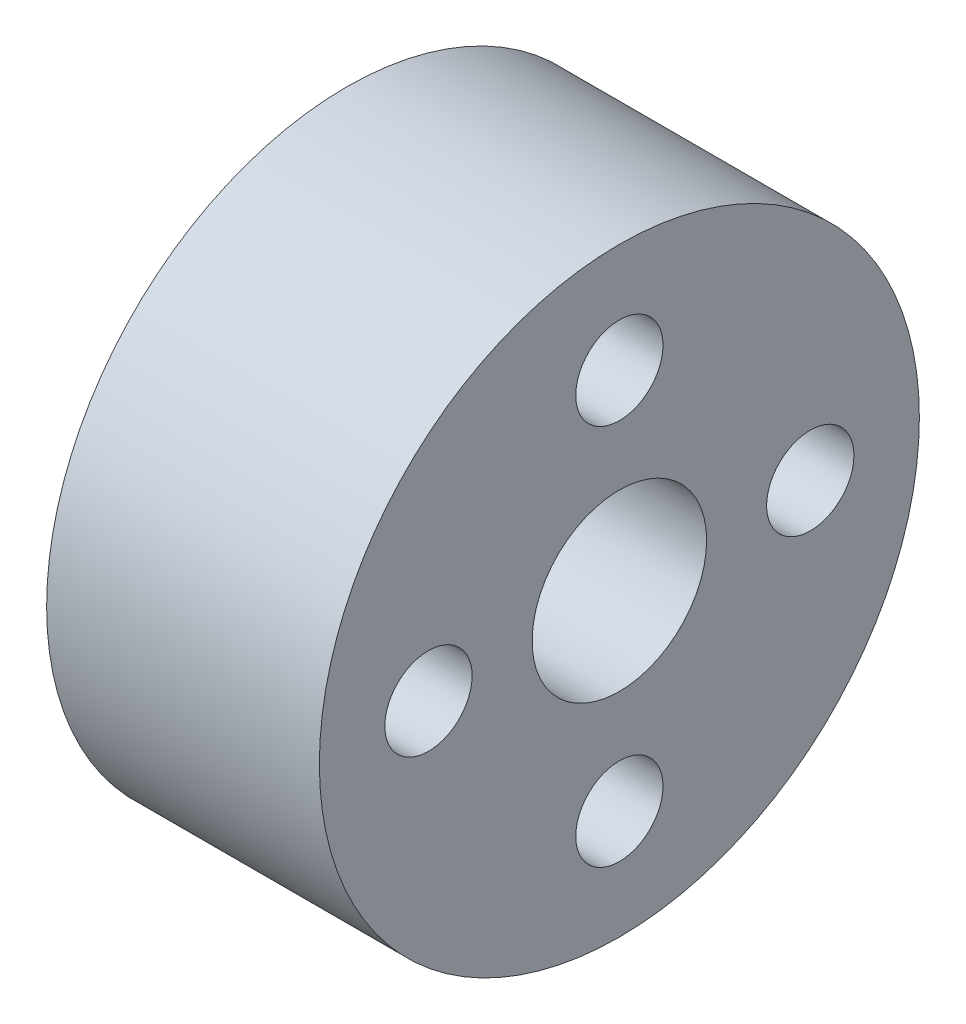
ISO-10303-21;
HEADER;
FILE_DESCRIPTION(('STEP AP214'),'2;1');
FILE_NAME('part.step','',(''),(''),'','','');
FILE_SCHEMA(('AUTOMOTIVE_DESIGN { 1 0 10303 214 1 1 1 1 }'));
ENDSEC;
DATA;
#1=APPLICATION_CONTEXT('core data for automotive mechanical design processes');
#2=APPLICATION_PROTOCOL_DEFINITION('international standard','automotive_design',2000,#1);
#3=PRODUCT_CONTEXT('',#1,'mechanical');
#4=PRODUCT('Part','Part','',(#3));
#5=PRODUCT_RELATED_PRODUCT_CATEGORY('part','',(#4));
#6=PRODUCT_DEFINITION_FORMATION('','',#4);
#7=PRODUCT_DEFINITION_CONTEXT('part definition',#1,'design');
#8=PRODUCT_DEFINITION('design','',#6,#7);
#9=PRODUCT_DEFINITION_SHAPE('','',#8);
#10=(LENGTH_UNIT() NAMED_UNIT(*) SI_UNIT(.MILLI.,.METRE.));
#11=(NAMED_UNIT(*) PLANE_ANGLE_UNIT() SI_UNIT($,.RADIAN.));
#12=(NAMED_UNIT(*) SI_UNIT($,.STERADIAN.) SOLID_ANGLE_UNIT());
#13=UNCERTAINTY_MEASURE_WITH_UNIT(LENGTH_MEASURE(1.E-05),#10,'distance_accuracy_value','');
#14=(GEOMETRIC_REPRESENTATION_CONTEXT(3) GLOBAL_UNCERTAINTY_ASSIGNED_CONTEXT((#13)) GLOBAL_UNIT_ASSIGNED_CONTEXT((#10,
#11,#12)) REPRESENTATION_CONTEXT('',''));
#15=CARTESIAN_POINT('',(0.,0.,0.));
#16=DIRECTION('',(0.,0.,1.));
#17=DIRECTION('',(1.,0.,0.));
#18=AXIS2_PLACEMENT_3D('',#15,#16,#17);
#19=CARTESIAN_POINT('',(10.,0.,0.));
#20=DIRECTION('',(1.,0.,0.));
#21=DIRECTION('',(0.,0.,-1.));
#22=AXIS2_PLACEMENT_3D('',#19,#20,#21);
#23=PLANE('',#22);
#24=CARTESIAN_POINT('',(10.,-7.,0.));
#25=DIRECTION('',(1.,0.,0.));
#26=DIRECTION('',(0.,0.,-1.));
#27=AXIS2_PLACEMENT_3D('',#24,#25,#26);
#28=CIRCLE('',#27,1.6);
#29=CARTESIAN_POINT('',(10.,-7.,-1.6));
#30=VERTEX_POINT('',#29);
#31=EDGE_CURVE('E64',#30,#30,#28,.T.);
#32=ORIENTED_EDGE('',*,*,#31,.F.);
#33=EDGE_LOOP('',(#32));
#34=FACE_BOUND('',#33,.T.);
#35=CARTESIAN_POINT('',(10.,7.,0.));
#36=DIRECTION('',(1.,0.,0.));
#37=DIRECTION('',(0.,0.,-1.));
#38=AXIS2_PLACEMENT_3D('',#35,#36,#37);
#39=CIRCLE('',#38,1.6);
#40=CARTESIAN_POINT('',(10.,7.,-1.6));
#41=VERTEX_POINT('',#40);
#42=EDGE_CURVE('E52',#41,#41,#39,.T.);
#43=ORIENTED_EDGE('',*,*,#42,.F.);
#44=EDGE_LOOP('',(#43));
#45=FACE_BOUND('',#44,.T.);
#46=CARTESIAN_POINT('',(10.,0.,0.));
#47=DIRECTION('',(1.,0.,0.));
#48=DIRECTION('',(0.,0.,-1.));
#49=AXIS2_PLACEMENT_3D('',#46,#47,#48);
#50=CIRCLE('',#49,11.);
#51=CARTESIAN_POINT('',(10.,0.,-11.));
#52=VERTEX_POINT('',#51);
#53=EDGE_CURVE('E10',#52,#52,#50,.T.);
#54=ORIENTED_EDGE('',*,*,#53,.T.);
#55=EDGE_LOOP('',(#54));
#56=FACE_BOUND('',#55,.T.);
#57=CARTESIAN_POINT('',(10.,0.,0.));
#58=DIRECTION('',(1.,0.,0.));
#59=DIRECTION('',(0.,0.,-1.));
#60=AXIS2_PLACEMENT_3D('',#57,#58,#59);
#61=CIRCLE('',#60,3.2);
#62=CARTESIAN_POINT('',(10.,0.,-3.2));
#63=VERTEX_POINT('',#62);
#64=EDGE_CURVE('E47',#63,#63,#61,.T.);
#65=ORIENTED_EDGE('',*,*,#64,.F.);
#66=EDGE_LOOP('',(#65));
#67=FACE_BOUND('',#66,.T.);
#68=CARTESIAN_POINT('',(10.,0.,7.));
#69=DIRECTION('',(1.,0.,0.));
#70=DIRECTION('',(0.,0.,-1.));
#71=AXIS2_PLACEMENT_3D('',#68,#69,#70);
#72=CIRCLE('',#71,1.6);
#73=CARTESIAN_POINT('',(10.,0.,5.4));
#74=VERTEX_POINT('',#73);
#75=EDGE_CURVE('E58',#74,#74,#72,.T.);
#76=ORIENTED_EDGE('',*,*,#75,.F.);
#77=EDGE_LOOP('',(#76));
#78=FACE_BOUND('',#77,.T.);
#79=CARTESIAN_POINT('',(10.,0.,-7.));
#80=DIRECTION('',(1.,0.,0.));
#81=DIRECTION('',(0.,0.,-1.));
#82=AXIS2_PLACEMENT_3D('',#79,#80,#81);
#83=CIRCLE('',#82,1.6);
#84=CARTESIAN_POINT('',(10.,0.,-8.6));
#85=VERTEX_POINT('',#84);
#86=EDGE_CURVE('E70',#85,#85,#83,.T.);
#87=ORIENTED_EDGE('',*,*,#86,.F.);
#88=EDGE_LOOP('',(#87));
#89=FACE_BOUND('',#88,.T.);
#90=ADVANCED_FACE('F36',(#34,#45,#56,#67,#78,#89),#23,.T.);
#91=CARTESIAN_POINT('',(0.,0.,0.));
#92=DIRECTION('',(1.,0.,0.));
#93=DIRECTION('',(0.,0.,-1.));
#94=AXIS2_PLACEMENT_3D('',#91,#92,#93);
#95=PLANE('',#94);
#96=CARTESIAN_POINT('',(0.,0.,0.));
#97=DIRECTION('',(1.,0.,0.));
#98=DIRECTION('',(0.,0.,-1.));
#99=AXIS2_PLACEMENT_3D('',#96,#97,#98);
#100=CIRCLE('',#99,11.);
#101=CARTESIAN_POINT('',(0.,0.,-11.));
#102=VERTEX_POINT('',#101);
#103=EDGE_CURVE('E40',#102,#102,#100,.T.);
#104=ORIENTED_EDGE('',*,*,#103,.F.);
#105=EDGE_LOOP('',(#104));
#106=FACE_BOUND('',#105,.T.);
#107=CARTESIAN_POINT('',(0.,0.,0.));
#108=DIRECTION('',(1.,0.,0.));
#109=DIRECTION('',(0.,0.,-1.));
#110=AXIS2_PLACEMENT_3D('',#107,#108,#109);
#111=CIRCLE('',#110,3.2);
#112=CARTESIAN_POINT('',(0.,0.,-3.2));
#113=VERTEX_POINT('',#112);
#114=EDGE_CURVE('E49',#113,#113,#111,.T.);
#115=ORIENTED_EDGE('',*,*,#114,.T.);
#116=EDGE_LOOP('',(#115));
#117=FACE_BOUND('',#116,.T.);
#118=CARTESIAN_POINT('',(0.,7.,0.));
#119=DIRECTION('',(1.,0.,0.));
#120=DIRECTION('',(0.,0.,-1.));
#121=AXIS2_PLACEMENT_3D('',#118,#119,#120);
#122=CIRCLE('',#121,1.6);
#123=CARTESIAN_POINT('',(0.,7.,-1.6));
#124=VERTEX_POINT('',#123);
#125=EDGE_CURVE('E55',#124,#124,#122,.T.);
#126=ORIENTED_EDGE('',*,*,#125,.T.);
#127=EDGE_LOOP('',(#126));
#128=FACE_BOUND('',#127,.T.);
#129=CARTESIAN_POINT('',(0.,0.,7.));
#130=DIRECTION('',(1.,0.,0.));
#131=DIRECTION('',(0.,0.,-1.));
#132=AXIS2_PLACEMENT_3D('',#129,#130,#131);
#133=CIRCLE('',#132,1.6);
#134=CARTESIAN_POINT('',(0.,0.,5.4));
#135=VERTEX_POINT('',#134);
#136=EDGE_CURVE('E61',#135,#135,#133,.T.);
#137=ORIENTED_EDGE('',*,*,#136,.T.);
#138=EDGE_LOOP('',(#137));
#139=FACE_BOUND('',#138,.T.);
#140=CARTESIAN_POINT('',(0.,-7.,0.));
#141=DIRECTION('',(1.,0.,0.));
#142=DIRECTION('',(0.,0.,-1.));
#143=AXIS2_PLACEMENT_3D('',#140,#141,#142);
#144=CIRCLE('',#143,1.6);
#145=CARTESIAN_POINT('',(0.,-7.,-1.6));
#146=VERTEX_POINT('',#145);
#147=EDGE_CURVE('E67',#146,#146,#144,.T.);
#148=ORIENTED_EDGE('',*,*,#147,.T.);
#149=EDGE_LOOP('',(#148));
#150=FACE_BOUND('',#149,.T.);
#151=CARTESIAN_POINT('',(0.,0.,-7.));
#152=DIRECTION('',(1.,0.,0.));
#153=DIRECTION('',(0.,0.,-1.));
#154=AXIS2_PLACEMENT_3D('',#151,#152,#153);
#155=CIRCLE('',#154,1.6);
#156=CARTESIAN_POINT('',(0.,0.,-8.6));
#157=VERTEX_POINT('',#156);
#158=EDGE_CURVE('E73',#157,#157,#155,.T.);
#159=ORIENTED_EDGE('',*,*,#158,.T.);
#160=EDGE_LOOP('',(#159));
#161=FACE_BOUND('',#160,.T.);
#162=ADVANCED_FACE('F83',(#106,#117,#128,#139,#150,#161),#95,.F.);
#163=CARTESIAN_POINT('',(10.,0.,0.));
#164=DIRECTION('',(-1.,0.,0.));
#165=DIRECTION('',(0.,0.,1.));
#166=AXIS2_PLACEMENT_3D('',#163,#164,#165);
#167=CYLINDRICAL_SURFACE('',#166,11.);
#168=ORIENTED_EDGE('',*,*,#53,.F.);
#169=EDGE_LOOP('',(#168));
#170=FACE_BOUND('',#169,.T.);
#171=ORIENTED_EDGE('',*,*,#103,.T.);
#172=EDGE_LOOP('',(#171));
#173=FACE_BOUND('',#172,.T.);
#174=ADVANCED_FACE('F38',(#170,#173),#167,.T.);
#175=CARTESIAN_POINT('',(10.,0.,0.));
#176=DIRECTION('',(-1.,0.,0.));
#177=DIRECTION('',(0.,0.,1.));
#178=AXIS2_PLACEMENT_3D('',#175,#176,#177);
#179=CYLINDRICAL_SURFACE('',#178,3.2);
#180=ORIENTED_EDGE('',*,*,#64,.T.);
#181=EDGE_LOOP('',(#180));
#182=FACE_BOUND('',#181,.T.);
#183=ORIENTED_EDGE('',*,*,#114,.F.);
#184=EDGE_LOOP('',(#183));
#185=FACE_BOUND('',#184,.T.);
#186=ADVANCED_FACE('F93',(#182,#185),#179,.F.);
#187=CARTESIAN_POINT('',(10.,7.,0.));
#188=DIRECTION('',(-1.,0.,0.));
#189=DIRECTION('',(0.,0.,1.));
#190=AXIS2_PLACEMENT_3D('',#187,#188,#189);
#191=CYLINDRICAL_SURFACE('',#190,1.6);
#192=ORIENTED_EDGE('',*,*,#42,.T.);
#193=EDGE_LOOP('',(#192));
#194=FACE_BOUND('',#193,.T.);
#195=ORIENTED_EDGE('',*,*,#125,.F.);
#196=EDGE_LOOP('',(#195));
#197=FACE_BOUND('',#196,.T.);
#198=ADVANCED_FACE('F96',(#194,#197),#191,.F.);
#199=CARTESIAN_POINT('',(10.,0.,7.));
#200=DIRECTION('',(-1.,0.,0.));
#201=DIRECTION('',(0.,0.,1.));
#202=AXIS2_PLACEMENT_3D('',#199,#200,#201);
#203=CYLINDRICAL_SURFACE('',#202,1.6);
#204=ORIENTED_EDGE('',*,*,#75,.T.);
#205=EDGE_LOOP('',(#204));
#206=FACE_BOUND('',#205,.T.);
#207=ORIENTED_EDGE('',*,*,#136,.F.);
#208=EDGE_LOOP('',(#207));
#209=FACE_BOUND('',#208,.T.);
#210=ADVANCED_FACE('F100',(#206,#209),#203,.F.);
#211=CARTESIAN_POINT('',(10.,-7.,0.));
#212=DIRECTION('',(-1.,0.,0.));
#213=DIRECTION('',(0.,0.,1.));
#214=AXIS2_PLACEMENT_3D('',#211,#212,#213);
#215=CYLINDRICAL_SURFACE('',#214,1.6);
#216=ORIENTED_EDGE('',*,*,#31,.T.);
#217=EDGE_LOOP('',(#216));
#218=FACE_BOUND('',#217,.T.);
#219=ORIENTED_EDGE('',*,*,#147,.F.);
#220=EDGE_LOOP('',(#219));
#221=FACE_BOUND('',#220,.T.);
#222=ADVANCED_FACE('F104',(#218,#221),#215,.F.);
#223=CARTESIAN_POINT('',(10.,0.,-7.));
#224=DIRECTION('',(-1.,0.,0.));
#225=DIRECTION('',(0.,0.,1.));
#226=AXIS2_PLACEMENT_3D('',#223,#224,#225);
#227=CYLINDRICAL_SURFACE('',#226,1.6);
#228=ORIENTED_EDGE('',*,*,#86,.T.);
#229=EDGE_LOOP('',(#228));
#230=FACE_BOUND('',#229,.T.);
#231=ORIENTED_EDGE('',*,*,#158,.F.);
#232=EDGE_LOOP('',(#231));
#233=FACE_BOUND('',#232,.T.);
#234=ADVANCED_FACE('F79',(#230,#233),#227,.F.);
#235=CLOSED_SHELL('',(#90,#162,#174,#186,#198,#210,#222,#234));
#236=MANIFOLD_SOLID_BREP('B2',#235);
#237=ADVANCED_BREP_SHAPE_REPRESENTATION('',(#18,#236),#14);
#238=SHAPE_DEFINITION_REPRESENTATION(#9,#237);
ENDSEC;
END-ISO-10303-21;
